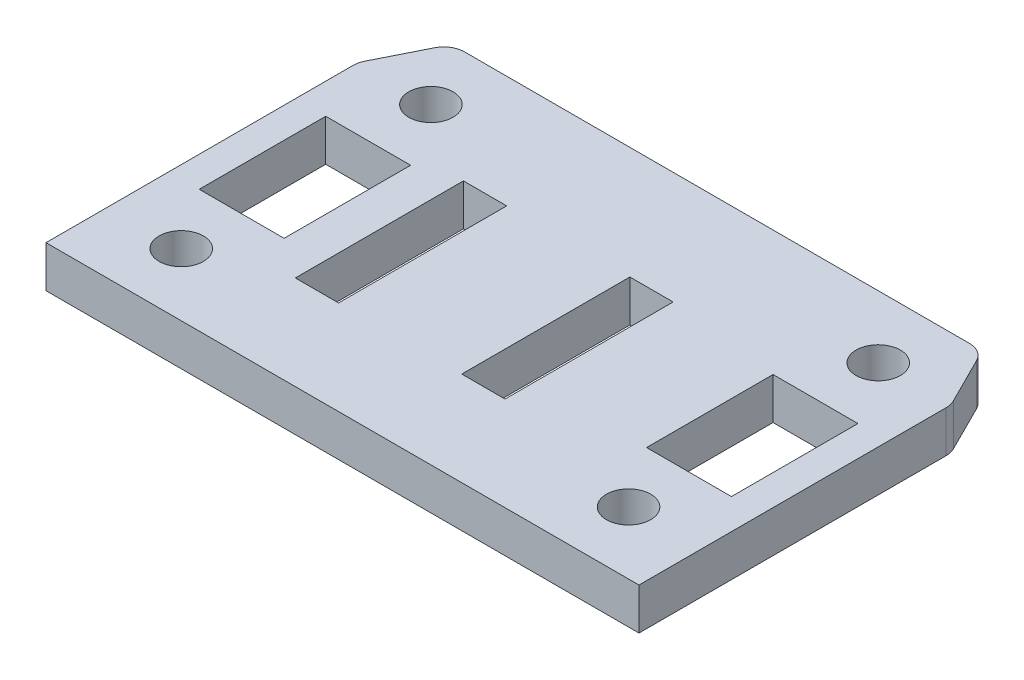
ISO-10303-21;
HEADER;
FILE_DESCRIPTION(('STEP AP214'),'2;1');
FILE_NAME('part.step','',(''),(''),'','','');
FILE_SCHEMA(('AUTOMOTIVE_DESIGN { 1 0 10303 214 1 1 1 1 }'));
ENDSEC;
DATA;
#1=APPLICATION_CONTEXT('core data for automotive mechanical design processes');
#2=APPLICATION_PROTOCOL_DEFINITION('international standard','automotive_design',2000,#1);
#3=PRODUCT_CONTEXT('',#1,'mechanical');
#4=PRODUCT('Part','Part','',(#3));
#5=PRODUCT_RELATED_PRODUCT_CATEGORY('part','',(#4));
#6=PRODUCT_DEFINITION_FORMATION('','',#4);
#7=PRODUCT_DEFINITION_CONTEXT('part definition',#1,'design');
#8=PRODUCT_DEFINITION('design','',#6,#7);
#9=PRODUCT_DEFINITION_SHAPE('','',#8);
#10=(LENGTH_UNIT() NAMED_UNIT(*) SI_UNIT(.MILLI.,.METRE.));
#11=(NAMED_UNIT(*) PLANE_ANGLE_UNIT() SI_UNIT($,.RADIAN.));
#12=(NAMED_UNIT(*) SI_UNIT($,.STERADIAN.) SOLID_ANGLE_UNIT());
#13=UNCERTAINTY_MEASURE_WITH_UNIT(LENGTH_MEASURE(1.E-05),#10,'distance_accuracy_value','');
#14=(GEOMETRIC_REPRESENTATION_CONTEXT(3) GLOBAL_UNCERTAINTY_ASSIGNED_CONTEXT((#13)) GLOBAL_UNIT_ASSIGNED_CONTEXT((#10,
#11,#12)) REPRESENTATION_CONTEXT('',''));
#15=CARTESIAN_POINT('',(0.,0.,0.));
#16=DIRECTION('',(0.,0.,1.));
#17=DIRECTION('',(1.,0.,0.));
#18=AXIS2_PLACEMENT_3D('',#15,#16,#17);
#19=CARTESIAN_POINT('',(-40.48125,6.35,28.575));
#20=DIRECTION('',(0.,0.,-1.));
#21=DIRECTION('',(-1.,0.,0.));
#22=AXIS2_PLACEMENT_3D('',#19,#20,#21);
#23=PLANE('',#22);
#24=DIRECTION('',(1.,0.,0.));
#25=VECTOR('',#24,1.);
#26=CARTESIAN_POINT('',(-40.48125,0.,28.575));
#27=LINE('',#26,#25);
#28=CARTESIAN_POINT('',(-45.24375,0.,28.575));
#29=VERTEX_POINT('',#28);
#30=CARTESIAN_POINT('',(45.24375,0.,28.575));
#31=VERTEX_POINT('',#30);
#32=EDGE_CURVE('E188',#29,#31,#27,.T.);
#33=ORIENTED_EDGE('',*,*,#32,.T.);
#34=DIRECTION('',(0.,1.,0.));
#35=VECTOR('',#34,1.);
#36=CARTESIAN_POINT('',(45.24375,-57.3480941814983,28.575));
#37=LINE('',#36,#35);
#38=CARTESIAN_POINT('',(45.24375,6.35,28.575));
#39=VERTEX_POINT('',#38);
#40=EDGE_CURVE('E186',#31,#39,#37,.T.);
#41=ORIENTED_EDGE('',*,*,#40,.T.);
#42=DIRECTION('',(1.,0.,0.));
#43=VECTOR('',#42,1.);
#44=CARTESIAN_POINT('',(-40.48125,6.35,28.575));
#45=LINE('',#44,#43);
#46=CARTESIAN_POINT('',(-45.24375,6.35,28.575));
#47=VERTEX_POINT('',#46);
#48=EDGE_CURVE('E125',#47,#39,#45,.T.);
#49=ORIENTED_EDGE('',*,*,#48,.F.);
#50=DIRECTION('',(0.,1.,0.));
#51=VECTOR('',#50,1.);
#52=CARTESIAN_POINT('',(-45.24375,-57.3480941814983,28.575));
#53=LINE('',#52,#51);
#54=EDGE_CURVE('E130',#29,#47,#53,.T.);
#55=ORIENTED_EDGE('',*,*,#54,.F.);
#56=EDGE_LOOP('',(#33,#41,#49,#55));
#57=FACE_BOUND('',#56,.T.);
#58=ADVANCED_FACE('F37',(#57),#23,.F.);
#59=CARTESIAN_POINT('',(-40.48125,6.35,-28.575));
#60=DIRECTION('',(0.,0.,1.));
#61=DIRECTION('',(1.,0.,0.));
#62=AXIS2_PLACEMENT_3D('',#59,#60,#61);
#63=PLANE('',#62);
#64=DIRECTION('',(-1.,0.,0.));
#65=VECTOR('',#64,1.);
#66=CARTESIAN_POINT('',(-40.48125,0.,-28.575));
#67=LINE('',#66,#65);
#68=CARTESIAN_POINT('',(38.5189920857191,0.,-28.575));
#69=VERTEX_POINT('',#68);
#70=CARTESIAN_POINT('',(-38.5189920857191,0.,-28.575));
#71=VERTEX_POINT('',#70);
#72=EDGE_CURVE('E154',#69,#71,#67,.T.);
#73=ORIENTED_EDGE('',*,*,#72,.T.);
#74=DIRECTION('',(0.,-1.,0.));
#75=VECTOR('',#74,1.);
#76=CARTESIAN_POINT('',(-38.5189920857191,6.35,-28.575));
#77=LINE('',#76,#75);
#78=CARTESIAN_POINT('',(-38.5189920857191,6.35,-28.575));
#79=VERTEX_POINT('',#78);
#80=EDGE_CURVE('E151',#71,#79,#77,.F.);
#81=ORIENTED_EDGE('',*,*,#80,.T.);
#82=DIRECTION('',(-1.,0.,0.));
#83=VECTOR('',#82,1.);
#84=CARTESIAN_POINT('',(-40.48125,6.35,-28.575));
#85=LINE('',#84,#83);
#86=CARTESIAN_POINT('',(38.5189920857191,6.35,-28.575));
#87=VERTEX_POINT('',#86);
#88=EDGE_CURVE('E109',#87,#79,#85,.T.);
#89=ORIENTED_EDGE('',*,*,#88,.F.);
#90=DIRECTION('',(0.,-1.,0.));
#91=VECTOR('',#90,1.);
#92=CARTESIAN_POINT('',(38.5189920857191,0.,-28.575));
#93=LINE('',#92,#91);
#94=EDGE_CURVE('E147',#87,#69,#93,.T.);
#95=ORIENTED_EDGE('',*,*,#94,.T.);
#96=EDGE_LOOP('',(#73,#81,#89,#95));
#97=FACE_BOUND('',#96,.T.);
#98=ADVANCED_FACE('F442',(#97),#63,.F.);
#99=CARTESIAN_POINT('',(0.,6.35,0.));
#100=DIRECTION('',(0.,-1.,0.));
#101=DIRECTION('',(0.,0.,-1.));
#102=AXIS2_PLACEMENT_3D('',#99,#100,#101);
#103=PLANE('',#102);
#104=DIRECTION('',(0.,0.,-1.));
#105=VECTOR('',#104,1.);
#106=CARTESIAN_POINT('',(40.6082500000001,6.35,9.82893668575267));
#107=LINE('',#106,#105);
#108=CARTESIAN_POINT('',(40.6082500000001,6.35,9.82893668575267));
#109=VERTEX_POINT('',#108);
#110=CARTESIAN_POINT('',(40.6082500000001,6.35,-9.47506331424733));
#111=VERTEX_POINT('',#110);
#112=EDGE_CURVE('E47',#109,#111,#107,.T.);
#113=ORIENTED_EDGE('',*,*,#112,.F.);
#114=DIRECTION('',(1.,0.,0.));
#115=VECTOR('',#114,1.);
#116=CARTESIAN_POINT('',(27.6542500000001,6.35,9.82893668575267));
#117=LINE('',#116,#115);
#118=CARTESIAN_POINT('',(27.6542500000001,6.35,9.82893668575267));
#119=VERTEX_POINT('',#118);
#120=EDGE_CURVE('E89',#119,#109,#117,.T.);
#121=ORIENTED_EDGE('',*,*,#120,.F.);
#122=DIRECTION('',(0.,0.,1.));
#123=VECTOR('',#122,1.);
#124=CARTESIAN_POINT('',(27.6542500000001,6.35,9.82893668575267));
#125=LINE('',#124,#123);
#126=CARTESIAN_POINT('',(27.6542500000001,6.35,-9.47506331424733));
#127=VERTEX_POINT('',#126);
#128=EDGE_CURVE('E75',#127,#119,#125,.T.);
#129=ORIENTED_EDGE('',*,*,#128,.F.);
#130=DIRECTION('',(-1.,0.,0.));
#131=VECTOR('',#130,1.);
#132=CARTESIAN_POINT('',(27.6542500000001,6.35,-9.47506331424733));
#133=LINE('',#132,#131);
#134=EDGE_CURVE('E80',#111,#127,#133,.T.);
#135=ORIENTED_EDGE('',*,*,#134,.F.);
#136=EDGE_LOOP('',(#113,#121,#129,#135));
#137=FACE_BOUND('',#136,.T.);
#138=DIRECTION('',(0.,0.,-1.));
#139=VECTOR('',#138,1.);
#140=CARTESIAN_POINT('',(-27.6542499999999,6.35,9.82893668575267));
#141=LINE('',#140,#139);
#142=CARTESIAN_POINT('',(-27.6542499999999,6.35,9.82893668575267));
#143=VERTEX_POINT('',#142);
#144=CARTESIAN_POINT('',(-27.6542499999999,6.35,-9.47506331424733));
#145=VERTEX_POINT('',#144);
#146=EDGE_CURVE('E733',#143,#145,#141,.T.);
#147=ORIENTED_EDGE('',*,*,#146,.F.);
#148=DIRECTION('',(1.,0.,0.));
#149=VECTOR('',#148,1.);
#150=CARTESIAN_POINT('',(-40.6082499999999,6.35,9.82893668575267));
#151=LINE('',#150,#149);
#152=CARTESIAN_POINT('',(-40.6082499999999,6.35,9.82893668575267));
#153=VERTEX_POINT('',#152);
#154=EDGE_CURVE('E289',#153,#143,#151,.T.);
#155=ORIENTED_EDGE('',*,*,#154,.F.);
#156=DIRECTION('',(0.,0.,1.));
#157=VECTOR('',#156,1.);
#158=CARTESIAN_POINT('',(-40.6082499999999,6.35,9.82893668575267));
#159=LINE('',#158,#157);
#160=CARTESIAN_POINT('',(-40.6082499999999,6.35,-9.47506331424733));
#161=VERTEX_POINT('',#160);
#162=EDGE_CURVE('E745',#161,#153,#159,.T.);
#163=ORIENTED_EDGE('',*,*,#162,.F.);
#164=DIRECTION('',(-1.,0.,0.));
#165=VECTOR('',#164,1.);
#166=CARTESIAN_POINT('',(-40.6082499999999,6.35,-9.47506331424733));
#167=LINE('',#166,#165);
#168=EDGE_CURVE('E742',#145,#161,#167,.T.);
#169=ORIENTED_EDGE('',*,*,#168,.F.);
#170=EDGE_LOOP('',(#147,#155,#163,#169));
#171=FACE_BOUND('',#170,.T.);
#172=CARTESIAN_POINT('',(-34.13125,6.35,-19.05));
#173=DIRECTION('',(0.,1.,0.));
#174=DIRECTION('',(0.,0.,1.));
#175=AXIS2_PLACEMENT_3D('',#172,#173,#174);
#176=CIRCLE('',#175,3.3782);
#177=CARTESIAN_POINT('',(-34.13125,6.35,-15.6718));
#178=VERTEX_POINT('',#177);
#179=EDGE_CURVE('E174',#178,#178,#176,.T.);
#180=ORIENTED_EDGE('',*,*,#179,.F.);
#181=EDGE_LOOP('',(#180));
#182=FACE_BOUND('',#181,.T.);
#183=CARTESIAN_POINT('',(-34.13125,6.35,19.05));
#184=DIRECTION('',(0.,1.,0.));
#185=DIRECTION('',(0.,0.,1.));
#186=AXIS2_PLACEMENT_3D('',#183,#184,#185);
#187=CIRCLE('',#186,3.3782);
#188=CARTESIAN_POINT('',(-34.13125,6.35,22.4282));
#189=VERTEX_POINT('',#188);
#190=EDGE_CURVE('E180',#189,#189,#187,.T.);
#191=ORIENTED_EDGE('',*,*,#190,.F.);
#192=EDGE_LOOP('',(#191));
#193=FACE_BOUND('',#192,.T.);
#194=CARTESIAN_POINT('',(34.13125,6.35,19.05));
#195=DIRECTION('',(0.,1.,0.));
#196=DIRECTION('',(0.,0.,1.));
#197=AXIS2_PLACEMENT_3D('',#194,#195,#196);
#198=CIRCLE('',#197,3.3782);
#199=CARTESIAN_POINT('',(34.13125,6.35,22.4282));
#200=VERTEX_POINT('',#199);
#201=EDGE_CURVE('E197',#200,#200,#198,.T.);
#202=ORIENTED_EDGE('',*,*,#201,.F.);
#203=EDGE_LOOP('',(#202));
#204=FACE_BOUND('',#203,.T.);
#205=CARTESIAN_POINT('',(34.13125,6.35,-19.05));
#206=DIRECTION('',(0.,1.,0.));
#207=DIRECTION('',(0.,0.,1.));
#208=AXIS2_PLACEMENT_3D('',#205,#206,#207);
#209=CIRCLE('',#208,3.3782);
#210=CARTESIAN_POINT('',(34.13125,6.35,-15.6718));
#211=VERTEX_POINT('',#210);
#212=EDGE_CURVE('E203',#211,#211,#209,.T.);
#213=ORIENTED_EDGE('',*,*,#212,.F.);
#214=EDGE_LOOP('',(#213));
#215=FACE_BOUND('',#214,.T.);
#216=DIRECTION('',(0.,0.,1.));
#217=VECTOR('',#216,1.);
#218=CARTESIAN_POINT('',(-14.95425,6.35,14.2166787714717));
#219=LINE('',#218,#217);
#220=CARTESIAN_POINT('',(-14.95425,6.35,-11.4373212285283));
#221=VERTEX_POINT('',#220);
#222=CARTESIAN_POINT('',(-14.95425,6.35,14.2166787714717));
#223=VERTEX_POINT('',#222);
#224=EDGE_CURVE('E150',#221,#223,#219,.T.);
#225=ORIENTED_EDGE('',*,*,#224,.T.);
#226=DIRECTION('',(-1.,0.,0.));
#227=VECTOR('',#226,1.);
#228=CARTESIAN_POINT('',(-21.55825,6.35,14.2166787714717));
#229=LINE('',#228,#227);
#230=CARTESIAN_POINT('',(-21.55825,6.35,14.2166787714717));
#231=VERTEX_POINT('',#230);
#232=EDGE_CURVE('E278',#223,#231,#229,.T.);
#233=ORIENTED_EDGE('',*,*,#232,.T.);
#234=DIRECTION('',(0.,0.,-1.));
#235=VECTOR('',#234,1.);
#236=CARTESIAN_POINT('',(-21.55825,6.35,14.2166787714717));
#237=LINE('',#236,#235);
#238=CARTESIAN_POINT('',(-21.55825,6.35,-11.4373212285283));
#239=VERTEX_POINT('',#238);
#240=EDGE_CURVE('E281',#231,#239,#237,.T.);
#241=ORIENTED_EDGE('',*,*,#240,.T.);
#242=DIRECTION('',(1.,0.,0.));
#243=VECTOR('',#242,1.);
#244=CARTESIAN_POINT('',(-21.55825,6.35,-11.4373212285283));
#245=LINE('',#244,#243);
#246=EDGE_CURVE('E223',#239,#221,#245,.T.);
#247=ORIENTED_EDGE('',*,*,#246,.T.);
#248=EDGE_LOOP('',(#225,#233,#241,#247));
#249=FACE_BOUND('',#248,.T.);
#250=DIRECTION('',(0.,0.,-1.));
#251=VECTOR('',#250,1.);
#252=CARTESIAN_POINT('',(3.84175000000006,6.35,-11.4373212285283));
#253=LINE('',#252,#251);
#254=CARTESIAN_POINT('',(3.84175000000006,6.35,14.2166787714717));
#255=VERTEX_POINT('',#254);
#256=CARTESIAN_POINT('',(3.84175000000006,6.35,-11.4373212285283));
#257=VERTEX_POINT('',#256);
#258=EDGE_CURVE('E216',#255,#257,#253,.T.);
#259=ORIENTED_EDGE('',*,*,#258,.T.);
#260=DIRECTION('',(1.,0.,0.));
#261=VECTOR('',#260,1.);
#262=CARTESIAN_POINT('',(3.84175000000006,6.35,-11.4373212285283));
#263=LINE('',#262,#261);
#264=CARTESIAN_POINT('',(10.4457500000001,6.35,-11.4373212285283));
#265=VERTEX_POINT('',#264);
#266=EDGE_CURVE('E212',#257,#265,#263,.T.);
#267=ORIENTED_EDGE('',*,*,#266,.T.);
#268=DIRECTION('',(0.,0.,1.));
#269=VECTOR('',#268,1.);
#270=CARTESIAN_POINT('',(10.4457500000001,6.35,-11.4373212285283));
#271=LINE('',#270,#269);
#272=CARTESIAN_POINT('',(10.4457500000001,6.35,14.2166787714717));
#273=VERTEX_POINT('',#272);
#274=EDGE_CURVE('E215',#265,#273,#271,.T.);
#275=ORIENTED_EDGE('',*,*,#274,.T.);
#276=DIRECTION('',(-1.,0.,0.));
#277=VECTOR('',#276,1.);
#278=CARTESIAN_POINT('',(3.84175000000006,6.35,14.2166787714717));
#279=LINE('',#278,#277);
#280=EDGE_CURVE('E126',#273,#255,#279,.T.);
#281=ORIENTED_EDGE('',*,*,#280,.T.);
#282=EDGE_LOOP('',(#259,#267,#275,#281));
#283=FACE_BOUND('',#282,.T.);
#284=DIRECTION('',(0.447213595499957,0.,-0.894427190999917));
#285=VECTOR('',#284,1.);
#286=CARTESIAN_POINT('',(-43.815,6.35,-21.9074999999999));
#287=LINE('',#286,#285);
#288=CARTESIAN_POINT('',(-44.9085563314247,6.35,-19.7203873371505));
#289=VERTEX_POINT('',#288);
#290=CARTESIAN_POINT('',(-41.3587984171438,6.35,-26.8199031657124));
#291=VERTEX_POINT('',#290);
#292=EDGE_CURVE('E290',#289,#291,#287,.T.);
#293=ORIENTED_EDGE('',*,*,#292,.F.);
#294=CARTESIAN_POINT('',(-42.06875,6.35,-18.3004841714382));
#295=DIRECTION('',(0.,-1.,0.));
#296=DIRECTION('',(0.,0.,-1.));
#297=AXIS2_PLACEMENT_3D('',#294,#295,#296);
#298=CIRCLE('',#297,3.175);
#299=CARTESIAN_POINT('',(-45.24375,6.35,-18.3004841714382));
#300=VERTEX_POINT('',#299);
#301=EDGE_CURVE('E122',#289,#300,#298,.F.);
#302=ORIENTED_EDGE('',*,*,#301,.T.);
#303=DIRECTION('',(0.,0.,-1.));
#304=VECTOR('',#303,1.);
#305=CARTESIAN_POINT('',(-45.24375,6.35,0.));
#306=LINE('',#305,#304);
#307=EDGE_CURVE('E131',#47,#300,#306,.T.);
#308=ORIENTED_EDGE('',*,*,#307,.F.);
#309=ORIENTED_EDGE('',*,*,#48,.T.);
#310=DIRECTION('',(0.,0.,-1.));
#311=VECTOR('',#310,1.);
#312=CARTESIAN_POINT('',(45.24375,6.35,0.));
#313=LINE('',#312,#311);
#314=CARTESIAN_POINT('',(45.24375,6.35,-18.3004841714381));
#315=VERTEX_POINT('',#314);
#316=EDGE_CURVE('E183',#39,#315,#313,.T.);
#317=ORIENTED_EDGE('',*,*,#316,.T.);
#318=CARTESIAN_POINT('',(42.06875,6.35,-18.3004841714381));
#319=DIRECTION('',(0.,-1.,0.));
#320=DIRECTION('',(0.,0.,-1.));
#321=AXIS2_PLACEMENT_3D('',#318,#319,#320);
#322=CIRCLE('',#321,3.175);
#323=CARTESIAN_POINT('',(44.9085563314247,6.35,-19.7203873371505));
#324=VERTEX_POINT('',#323);
#325=EDGE_CURVE('E293',#315,#324,#322,.F.);
#326=ORIENTED_EDGE('',*,*,#325,.T.);
#327=DIRECTION('',(-0.447213595499958,0.,-0.894427190999916));
#328=VECTOR('',#327,1.);
#329=CARTESIAN_POINT('',(43.815,6.35,-21.9075));
#330=LINE('',#329,#328);
#331=CARTESIAN_POINT('',(41.3587984171438,6.35,-26.8199031657124));
#332=VERTEX_POINT('',#331);
#333=EDGE_CURVE('E295',#324,#332,#330,.T.);
#334=ORIENTED_EDGE('',*,*,#333,.T.);
#335=CARTESIAN_POINT('',(38.5189920857191,6.35,-25.4));
#336=DIRECTION('',(0.,-1.,0.));
#337=DIRECTION('',(0.,0.,-1.));
#338=AXIS2_PLACEMENT_3D('',#335,#336,#337);
#339=CIRCLE('',#338,3.175);
#340=EDGE_CURVE('E117',#332,#87,#339,.F.);
#341=ORIENTED_EDGE('',*,*,#340,.T.);
#342=ORIENTED_EDGE('',*,*,#88,.T.);
#343=CARTESIAN_POINT('',(-38.5189920857191,6.35,-25.4));
#344=DIRECTION('',(0.,-1.,0.));
#345=DIRECTION('',(0.,0.,-1.));
#346=AXIS2_PLACEMENT_3D('',#343,#344,#345);
#347=CIRCLE('',#346,3.175);
#348=EDGE_CURVE('E106',#79,#291,#347,.F.);
#349=ORIENTED_EDGE('',*,*,#348,.T.);
#350=EDGE_LOOP('',(#293,#302,#308,#309,#317,#326,#334,#341,#342,#349));
#351=FACE_BOUND('',#350,.T.);
#352=ADVANCED_FACE('F39',(#137,#171,#182,#193,#204,#215,#249,#283,#351),#103,.F.);
#353=CARTESIAN_POINT('',(0.,0.,0.));
#354=DIRECTION('',(0.,-1.,0.));
#355=DIRECTION('',(0.,0.,-1.));
#356=AXIS2_PLACEMENT_3D('',#353,#354,#355);
#357=PLANE('',#356);
#358=DIRECTION('',(1.,0.,0.));
#359=VECTOR('',#358,1.);
#360=CARTESIAN_POINT('',(27.6542500000001,0.,9.82893668575267));
#361=LINE('',#360,#359);
#362=CARTESIAN_POINT('',(27.6542500000001,0.,9.82893668575267));
#363=VERTEX_POINT('',#362);
#364=CARTESIAN_POINT('',(40.6082500000001,0.,9.82893668575267));
#365=VERTEX_POINT('',#364);
#366=EDGE_CURVE('E41',#363,#365,#361,.T.);
#367=ORIENTED_EDGE('',*,*,#366,.T.);
#368=DIRECTION('',(0.,0.,-1.));
#369=VECTOR('',#368,1.);
#370=CARTESIAN_POINT('',(40.6082500000001,0.,9.82893668575267));
#371=LINE('',#370,#369);
#372=CARTESIAN_POINT('',(40.6082500000001,0.,-9.47506331424733));
#373=VERTEX_POINT('',#372);
#374=EDGE_CURVE('E101',#365,#373,#371,.T.);
#375=ORIENTED_EDGE('',*,*,#374,.T.);
#376=DIRECTION('',(-1.,0.,0.));
#377=VECTOR('',#376,1.);
#378=CARTESIAN_POINT('',(27.6542500000001,0.,-9.47506331424733));
#379=LINE('',#378,#377);
#380=CARTESIAN_POINT('',(27.6542500000001,0.,-9.47506331424733));
#381=VERTEX_POINT('',#380);
#382=EDGE_CURVE('E100',#373,#381,#379,.T.);
#383=ORIENTED_EDGE('',*,*,#382,.T.);
#384=DIRECTION('',(0.,0.,1.));
#385=VECTOR('',#384,1.);
#386=CARTESIAN_POINT('',(27.6542500000001,0.,9.82893668575267));
#387=LINE('',#386,#385);
#388=EDGE_CURVE('E78',#381,#363,#387,.T.);
#389=ORIENTED_EDGE('',*,*,#388,.T.);
#390=EDGE_LOOP('',(#367,#375,#383,#389));
#391=FACE_BOUND('',#390,.T.);
#392=DIRECTION('',(1.,0.,0.));
#393=VECTOR('',#392,1.);
#394=CARTESIAN_POINT('',(-40.6082499999999,0.,9.82893668575267));
#395=LINE('',#394,#393);
#396=CARTESIAN_POINT('',(-40.6082499999999,0.,9.82893668575267));
#397=VERTEX_POINT('',#396);
#398=CARTESIAN_POINT('',(-27.6542499999999,0.,9.82893668575267));
#399=VERTEX_POINT('',#398);
#400=EDGE_CURVE('E99',#397,#399,#395,.T.);
#401=ORIENTED_EDGE('',*,*,#400,.T.);
#402=DIRECTION('',(0.,0.,-1.));
#403=VECTOR('',#402,1.);
#404=CARTESIAN_POINT('',(-27.6542499999999,0.,9.82893668575267));
#405=LINE('',#404,#403);
#406=CARTESIAN_POINT('',(-27.6542499999999,0.,-9.47506331424733));
#407=VERTEX_POINT('',#406);
#408=EDGE_CURVE('E761',#399,#407,#405,.T.);
#409=ORIENTED_EDGE('',*,*,#408,.T.);
#410=DIRECTION('',(-1.,0.,0.));
#411=VECTOR('',#410,1.);
#412=CARTESIAN_POINT('',(-40.6082499999999,0.,-9.47506331424733));
#413=LINE('',#412,#411);
#414=CARTESIAN_POINT('',(-40.6082499999999,0.,-9.47506331424733));
#415=VERTEX_POINT('',#414);
#416=EDGE_CURVE('E758',#407,#415,#413,.T.);
#417=ORIENTED_EDGE('',*,*,#416,.T.);
#418=DIRECTION('',(0.,0.,1.));
#419=VECTOR('',#418,1.);
#420=CARTESIAN_POINT('',(-40.6082499999999,0.,9.82893668575267));
#421=LINE('',#420,#419);
#422=EDGE_CURVE('E194',#415,#397,#421,.T.);
#423=ORIENTED_EDGE('',*,*,#422,.T.);
#424=EDGE_LOOP('',(#401,#409,#417,#423));
#425=FACE_BOUND('',#424,.T.);
#426=CARTESIAN_POINT('',(-34.13125,0.,-19.05));
#427=DIRECTION('',(0.,1.,0.));
#428=DIRECTION('',(0.,0.,1.));
#429=AXIS2_PLACEMENT_3D('',#426,#427,#428);
#430=CIRCLE('',#429,3.3782);
#431=CARTESIAN_POINT('',(-34.13125,0.,-15.6718));
#432=VERTEX_POINT('',#431);
#433=EDGE_CURVE('E190',#432,#432,#430,.T.);
#434=ORIENTED_EDGE('',*,*,#433,.T.);
#435=EDGE_LOOP('',(#434));
#436=FACE_BOUND('',#435,.T.);
#437=CARTESIAN_POINT('',(-34.13125,0.,19.05));
#438=DIRECTION('',(0.,1.,0.));
#439=DIRECTION('',(0.,0.,1.));
#440=AXIS2_PLACEMENT_3D('',#437,#438,#439);
#441=CIRCLE('',#440,3.3782);
#442=CARTESIAN_POINT('',(-34.13125,0.,22.4282));
#443=VERTEX_POINT('',#442);
#444=EDGE_CURVE('E193',#443,#443,#441,.T.);
#445=ORIENTED_EDGE('',*,*,#444,.T.);
#446=EDGE_LOOP('',(#445));
#447=FACE_BOUND('',#446,.T.);
#448=CARTESIAN_POINT('',(34.13125,0.,19.05));
#449=DIRECTION('',(0.,1.,0.));
#450=DIRECTION('',(0.,0.,1.));
#451=AXIS2_PLACEMENT_3D('',#448,#449,#450);
#452=CIRCLE('',#451,3.3782);
#453=CARTESIAN_POINT('',(34.13125,0.,22.4282));
#454=VERTEX_POINT('',#453);
#455=EDGE_CURVE('E200',#454,#454,#452,.T.);
#456=ORIENTED_EDGE('',*,*,#455,.T.);
#457=EDGE_LOOP('',(#456));
#458=FACE_BOUND('',#457,.T.);
#459=CARTESIAN_POINT('',(34.13125,0.,-19.05));
#460=DIRECTION('',(0.,1.,0.));
#461=DIRECTION('',(0.,0.,1.));
#462=AXIS2_PLACEMENT_3D('',#459,#460,#461);
#463=CIRCLE('',#462,3.3782);
#464=CARTESIAN_POINT('',(34.13125,0.,-15.6718));
#465=VERTEX_POINT('',#464);
#466=EDGE_CURVE('E206',#465,#465,#463,.T.);
#467=ORIENTED_EDGE('',*,*,#466,.T.);
#468=EDGE_LOOP('',(#467));
#469=FACE_BOUND('',#468,.T.);
#470=DIRECTION('',(-1.,0.,0.));
#471=VECTOR('',#470,1.);
#472=CARTESIAN_POINT('',(-21.55825,0.,14.2166787714717));
#473=LINE('',#472,#471);
#474=CARTESIAN_POINT('',(-14.95425,0.,14.2166787714717));
#475=VERTEX_POINT('',#474);
#476=CARTESIAN_POINT('',(-21.55825,0.,14.2166787714717));
#477=VERTEX_POINT('',#476);
#478=EDGE_CURVE('E247',#475,#477,#473,.T.);
#479=ORIENTED_EDGE('',*,*,#478,.F.);
#480=DIRECTION('',(0.,0.,1.));
#481=VECTOR('',#480,1.);
#482=CARTESIAN_POINT('',(-14.95425,0.,14.2166787714717));
#483=LINE('',#482,#481);
#484=CARTESIAN_POINT('',(-14.95425,0.,-11.4373212285283));
#485=VERTEX_POINT('',#484);
#486=EDGE_CURVE('E264',#485,#475,#483,.T.);
#487=ORIENTED_EDGE('',*,*,#486,.F.);
#488=DIRECTION('',(1.,0.,0.));
#489=VECTOR('',#488,1.);
#490=CARTESIAN_POINT('',(-21.55825,0.,-11.4373212285283));
#491=LINE('',#490,#489);
#492=CARTESIAN_POINT('',(-21.55825,0.,-11.4373212285283));
#493=VERTEX_POINT('',#492);
#494=EDGE_CURVE('E260',#493,#485,#491,.T.);
#495=ORIENTED_EDGE('',*,*,#494,.F.);
#496=DIRECTION('',(0.,0.,-1.));
#497=VECTOR('',#496,1.);
#498=CARTESIAN_POINT('',(-21.55825,0.,14.2166787714717));
#499=LINE('',#498,#497);
#500=EDGE_CURVE('E256',#477,#493,#499,.T.);
#501=ORIENTED_EDGE('',*,*,#500,.F.);
#502=EDGE_LOOP('',(#479,#487,#495,#501));
#503=FACE_BOUND('',#502,.T.);
#504=DIRECTION('',(1.,0.,0.));
#505=VECTOR('',#504,1.);
#506=CARTESIAN_POINT('',(3.84175000000006,0.,-11.4373212285283));
#507=LINE('',#506,#505);
#508=CARTESIAN_POINT('',(3.84175000000006,0.,-11.4373212285283));
#509=VERTEX_POINT('',#508);
#510=CARTESIAN_POINT('',(10.4457500000001,0.,-11.4373212285283));
#511=VERTEX_POINT('',#510);
#512=EDGE_CURVE('E135',#509,#511,#507,.T.);
#513=ORIENTED_EDGE('',*,*,#512,.F.);
#514=DIRECTION('',(0.,0.,-1.));
#515=VECTOR('',#514,1.);
#516=CARTESIAN_POINT('',(3.84175000000006,0.,-11.4373212285283));
#517=LINE('',#516,#515);
#518=CARTESIAN_POINT('',(3.84175000000006,0.,14.2166787714717));
#519=VERTEX_POINT('',#518);
#520=EDGE_CURVE('E236',#519,#509,#517,.T.);
#521=ORIENTED_EDGE('',*,*,#520,.F.);
#522=DIRECTION('',(-1.,0.,0.));
#523=VECTOR('',#522,1.);
#524=CARTESIAN_POINT('',(3.84175000000006,0.,14.2166787714717));
#525=LINE('',#524,#523);
#526=CARTESIAN_POINT('',(10.4457500000001,0.,14.2166787714717));
#527=VERTEX_POINT('',#526);
#528=EDGE_CURVE('E232',#527,#519,#525,.T.);
#529=ORIENTED_EDGE('',*,*,#528,.F.);
#530=DIRECTION('',(0.,0.,1.));
#531=VECTOR('',#530,1.);
#532=CARTESIAN_POINT('',(10.4457500000001,0.,-11.4373212285283));
#533=LINE('',#532,#531);
#534=EDGE_CURVE('E227',#511,#527,#533,.T.);
#535=ORIENTED_EDGE('',*,*,#534,.F.);
#536=EDGE_LOOP('',(#513,#521,#529,#535));
#537=FACE_BOUND('',#536,.T.);
#538=DIRECTION('',(0.,0.,-1.));
#539=VECTOR('',#538,1.);
#540=CARTESIAN_POINT('',(-45.24375,0.,0.));
#541=LINE('',#540,#539);
#542=CARTESIAN_POINT('',(-45.24375,0.,-18.3004841714382));
#543=VERTEX_POINT('',#542);
#544=EDGE_CURVE('E146',#29,#543,#541,.T.);
#545=ORIENTED_EDGE('',*,*,#544,.T.);
#546=CARTESIAN_POINT('',(-42.06875,0.,-18.3004841714382));
#547=DIRECTION('',(0.,-1.,0.));
#548=DIRECTION('',(0.,0.,-1.));
#549=AXIS2_PLACEMENT_3D('',#546,#547,#548);
#550=CIRCLE('',#549,3.175);
#551=CARTESIAN_POINT('',(-44.9085563314247,0.,-19.7203873371505));
#552=VERTEX_POINT('',#551);
#553=EDGE_CURVE('E143',#543,#552,#550,.T.);
#554=ORIENTED_EDGE('',*,*,#553,.T.);
#555=DIRECTION('',(0.447213595499957,0.,-0.894427190999917));
#556=VECTOR('',#555,1.);
#557=CARTESIAN_POINT('',(-43.815,0.,-21.9074999999999));
#558=LINE('',#557,#556);
#559=CARTESIAN_POINT('',(-41.3587984171438,0.,-26.8199031657124));
#560=VERTEX_POINT('',#559);
#561=EDGE_CURVE('E142',#552,#560,#558,.T.);
#562=ORIENTED_EDGE('',*,*,#561,.T.);
#563=CARTESIAN_POINT('',(-38.5189920857191,0.,-25.4));
#564=DIRECTION('',(0.,-1.,0.));
#565=DIRECTION('',(0.,0.,-1.));
#566=AXIS2_PLACEMENT_3D('',#563,#564,#565);
#567=CIRCLE('',#566,3.175);
#568=EDGE_CURVE('E139',#560,#71,#567,.T.);
#569=ORIENTED_EDGE('',*,*,#568,.T.);
#570=ORIENTED_EDGE('',*,*,#72,.F.);
#571=CARTESIAN_POINT('',(38.5189920857191,0.,-25.4));
#572=DIRECTION('',(0.,-1.,0.));
#573=DIRECTION('',(0.,0.,-1.));
#574=AXIS2_PLACEMENT_3D('',#571,#572,#573);
#575=CIRCLE('',#574,3.175);
#576=CARTESIAN_POINT('',(41.3587984171438,0.,-26.8199031657124));
#577=VERTEX_POINT('',#576);
#578=EDGE_CURVE('E136',#69,#577,#575,.T.);
#579=ORIENTED_EDGE('',*,*,#578,.T.);
#580=DIRECTION('',(-0.447213595499958,0.,-0.894427190999916));
#581=VECTOR('',#580,1.);
#582=CARTESIAN_POINT('',(43.815,0.,-21.9075));
#583=LINE('',#582,#581);
#584=CARTESIAN_POINT('',(44.9085563314247,0.,-19.7203873371505));
#585=VERTEX_POINT('',#584);
#586=EDGE_CURVE('E161',#585,#577,#583,.T.);
#587=ORIENTED_EDGE('',*,*,#586,.F.);
#588=CARTESIAN_POINT('',(42.06875,0.,-18.3004841714381));
#589=DIRECTION('',(0.,-1.,0.));
#590=DIRECTION('',(0.,0.,-1.));
#591=AXIS2_PLACEMENT_3D('',#588,#589,#590);
#592=CIRCLE('',#591,3.175);
#593=CARTESIAN_POINT('',(45.24375,0.,-18.3004841714381));
#594=VERTEX_POINT('',#593);
#595=EDGE_CURVE('E132',#585,#594,#592,.T.);
#596=ORIENTED_EDGE('',*,*,#595,.T.);
#597=DIRECTION('',(0.,0.,-1.));
#598=VECTOR('',#597,1.);
#599=CARTESIAN_POINT('',(45.24375,0.,0.));
#600=LINE('',#599,#598);
#601=EDGE_CURVE('E164',#31,#594,#600,.T.);
#602=ORIENTED_EDGE('',*,*,#601,.F.);
#603=ORIENTED_EDGE('',*,*,#32,.F.);
#604=EDGE_LOOP('',(#545,#554,#562,#569,#570,#579,#587,#596,#602,#603));
#605=FACE_BOUND('',#604,.T.);
#606=ADVANCED_FACE('F430',(#391,#425,#436,#447,#458,#469,#503,#537,#605),#357,.T.);
#607=CARTESIAN_POINT('',(3.84175000000006,6.35,-11.4373212285283));
#608=DIRECTION('',(0.,0.,-1.));
#609=DIRECTION('',(-1.,0.,0.));
#610=AXIS2_PLACEMENT_3D('',#607,#608,#609);
#611=PLANE('',#610);
#612=ORIENTED_EDGE('',*,*,#512,.T.);
#613=DIRECTION('',(0.,-1.,0.));
#614=VECTOR('',#613,1.);
#615=CARTESIAN_POINT('',(10.4457500000001,6.35,-11.4373212285283));
#616=LINE('',#615,#614);
#617=EDGE_CURVE('E230',#265,#511,#616,.T.);
#618=ORIENTED_EDGE('',*,*,#617,.F.);
#619=ORIENTED_EDGE('',*,*,#266,.F.);
#620=DIRECTION('',(0.,-1.,0.));
#621=VECTOR('',#620,1.);
#622=CARTESIAN_POINT('',(3.84175000000006,6.35,-11.4373212285283));
#623=LINE('',#622,#621);
#624=EDGE_CURVE('E226',#257,#509,#623,.T.);
#625=ORIENTED_EDGE('',*,*,#624,.T.);
#626=EDGE_LOOP('',(#612,#618,#619,#625));
#627=FACE_BOUND('',#626,.T.);
#628=ADVANCED_FACE('F504',(#627),#611,.F.);
#629=CARTESIAN_POINT('',(3.84175000000006,6.35,-11.4373212285283));
#630=DIRECTION('',(-1.,0.,0.));
#631=DIRECTION('',(0.,0.,1.));
#632=AXIS2_PLACEMENT_3D('',#629,#630,#631);
#633=PLANE('',#632);
#634=ORIENTED_EDGE('',*,*,#520,.T.);
#635=ORIENTED_EDGE('',*,*,#624,.F.);
#636=ORIENTED_EDGE('',*,*,#258,.F.);
#637=DIRECTION('',(0.,-1.,0.));
#638=VECTOR('',#637,1.);
#639=CARTESIAN_POINT('',(3.84175000000006,6.35,14.2166787714717));
#640=LINE('',#639,#638);
#641=EDGE_CURVE('E235',#255,#519,#640,.T.);
#642=ORIENTED_EDGE('',*,*,#641,.T.);
#643=EDGE_LOOP('',(#634,#635,#636,#642));
#644=FACE_BOUND('',#643,.T.);
#645=ADVANCED_FACE('F500',(#644),#633,.F.);
#646=CARTESIAN_POINT('',(3.84175000000006,6.35,14.2166787714717));
#647=DIRECTION('',(0.,0.,1.));
#648=DIRECTION('',(1.,0.,0.));
#649=AXIS2_PLACEMENT_3D('',#646,#647,#648);
#650=PLANE('',#649);
#651=ORIENTED_EDGE('',*,*,#528,.T.);
#652=ORIENTED_EDGE('',*,*,#641,.F.);
#653=ORIENTED_EDGE('',*,*,#280,.F.);
#654=DIRECTION('',(0.,-1.,0.));
#655=VECTOR('',#654,1.);
#656=CARTESIAN_POINT('',(10.4457500000001,6.35,14.2166787714717));
#657=LINE('',#656,#655);
#658=EDGE_CURVE('E231',#273,#527,#657,.T.);
#659=ORIENTED_EDGE('',*,*,#658,.T.);
#660=EDGE_LOOP('',(#651,#652,#653,#659));
#661=FACE_BOUND('',#660,.T.);
#662=ADVANCED_FACE('F511',(#661),#650,.F.);
#663=CARTESIAN_POINT('',(10.4457500000001,6.35,-11.4373212285283));
#664=DIRECTION('',(1.,0.,0.));
#665=DIRECTION('',(0.,0.,-1.));
#666=AXIS2_PLACEMENT_3D('',#663,#664,#665);
#667=PLANE('',#666);
#668=ORIENTED_EDGE('',*,*,#534,.T.);
#669=ORIENTED_EDGE('',*,*,#658,.F.);
#670=ORIENTED_EDGE('',*,*,#274,.F.);
#671=ORIENTED_EDGE('',*,*,#617,.T.);
#672=EDGE_LOOP('',(#668,#669,#670,#671));
#673=FACE_BOUND('',#672,.T.);
#674=ADVANCED_FACE('F469',(#673),#667,.F.);
#675=CARTESIAN_POINT('',(-21.55825,6.35,14.2166787714717));
#676=DIRECTION('',(0.,0.,1.));
#677=DIRECTION('',(1.,0.,0.));
#678=AXIS2_PLACEMENT_3D('',#675,#676,#677);
#679=PLANE('',#678);
#680=ORIENTED_EDGE('',*,*,#478,.T.);
#681=DIRECTION('',(0.,-1.,0.));
#682=VECTOR('',#681,1.);
#683=CARTESIAN_POINT('',(-21.55825,6.35,14.2166787714717));
#684=LINE('',#683,#682);
#685=EDGE_CURVE('E209',#231,#477,#684,.T.);
#686=ORIENTED_EDGE('',*,*,#685,.F.);
#687=ORIENTED_EDGE('',*,*,#232,.F.);
#688=DIRECTION('',(0.,-1.,0.));
#689=VECTOR('',#688,1.);
#690=CARTESIAN_POINT('',(-14.95425,6.35,14.2166787714717));
#691=LINE('',#690,#689);
#692=EDGE_CURVE('E265',#223,#475,#691,.T.);
#693=ORIENTED_EDGE('',*,*,#692,.T.);
#694=EDGE_LOOP('',(#680,#686,#687,#693));
#695=FACE_BOUND('',#694,.T.);
#696=ADVANCED_FACE('F465',(#695),#679,.F.);
#697=CARTESIAN_POINT('',(-14.95425,6.35,14.2166787714717));
#698=DIRECTION('',(1.,0.,0.));
#699=DIRECTION('',(0.,0.,-1.));
#700=AXIS2_PLACEMENT_3D('',#697,#698,#699);
#701=PLANE('',#700);
#702=ORIENTED_EDGE('',*,*,#486,.T.);
#703=ORIENTED_EDGE('',*,*,#692,.F.);
#704=ORIENTED_EDGE('',*,*,#224,.F.);
#705=DIRECTION('',(0.,-1.,0.));
#706=VECTOR('',#705,1.);
#707=CARTESIAN_POINT('',(-14.95425,6.35,-11.4373212285283));
#708=LINE('',#707,#706);
#709=EDGE_CURVE('E261',#221,#485,#708,.T.);
#710=ORIENTED_EDGE('',*,*,#709,.T.);
#711=EDGE_LOOP('',(#702,#703,#704,#710));
#712=FACE_BOUND('',#711,.T.);
#713=ADVANCED_FACE('F468',(#712),#701,.F.);
#714=CARTESIAN_POINT('',(-21.55825,6.35,-11.4373212285283));
#715=DIRECTION('',(0.,0.,-1.));
#716=DIRECTION('',(-1.,0.,0.));
#717=AXIS2_PLACEMENT_3D('',#714,#715,#716);
#718=PLANE('',#717);
#719=ORIENTED_EDGE('',*,*,#494,.T.);
#720=ORIENTED_EDGE('',*,*,#709,.F.);
#721=ORIENTED_EDGE('',*,*,#246,.F.);
#722=DIRECTION('',(0.,-1.,0.));
#723=VECTOR('',#722,1.);
#724=CARTESIAN_POINT('',(-21.55825,6.35,-11.4373212285283));
#725=LINE('',#724,#723);
#726=EDGE_CURVE('E257',#239,#493,#725,.T.);
#727=ORIENTED_EDGE('',*,*,#726,.T.);
#728=EDGE_LOOP('',(#719,#720,#721,#727));
#729=FACE_BOUND('',#728,.T.);
#730=ADVANCED_FACE('F475',(#729),#718,.F.);
#731=CARTESIAN_POINT('',(-21.55825,6.35,14.2166787714717));
#732=DIRECTION('',(-1.,0.,0.));
#733=DIRECTION('',(0.,0.,1.));
#734=AXIS2_PLACEMENT_3D('',#731,#732,#733);
#735=PLANE('',#734);
#736=ORIENTED_EDGE('',*,*,#500,.T.);
#737=ORIENTED_EDGE('',*,*,#726,.F.);
#738=ORIENTED_EDGE('',*,*,#240,.F.);
#739=ORIENTED_EDGE('',*,*,#685,.T.);
#740=EDGE_LOOP('',(#736,#737,#738,#739));
#741=FACE_BOUND('',#740,.T.);
#742=ADVANCED_FACE('F471',(#741),#735,.F.);
#743=CARTESIAN_POINT('',(34.13125,6.35,-19.05));
#744=DIRECTION('',(0.,1.,0.));
#745=DIRECTION('',(0.,0.,1.));
#746=AXIS2_PLACEMENT_3D('',#743,#744,#745);
#747=CYLINDRICAL_SURFACE('',#746,3.3782);
#748=ORIENTED_EDGE('',*,*,#466,.F.);
#749=EDGE_LOOP('',(#748));
#750=FACE_BOUND('',#749,.T.);
#751=ORIENTED_EDGE('',*,*,#212,.T.);
#752=EDGE_LOOP('',(#751));
#753=FACE_BOUND('',#752,.T.);
#754=ADVANCED_FACE('F474',(#750,#753),#747,.F.);
#755=CARTESIAN_POINT('',(34.13125,6.35,19.05));
#756=DIRECTION('',(0.,1.,0.));
#757=DIRECTION('',(0.,0.,1.));
#758=AXIS2_PLACEMENT_3D('',#755,#756,#757);
#759=CYLINDRICAL_SURFACE('',#758,3.3782);
#760=ORIENTED_EDGE('',*,*,#455,.F.);
#761=EDGE_LOOP('',(#760));
#762=FACE_BOUND('',#761,.T.);
#763=ORIENTED_EDGE('',*,*,#201,.T.);
#764=EDGE_LOOP('',(#763));
#765=FACE_BOUND('',#764,.T.);
#766=ADVANCED_FACE('F563',(#762,#765),#759,.F.);
#767=CARTESIAN_POINT('',(-34.13125,6.35,19.05));
#768=DIRECTION('',(0.,1.,0.));
#769=DIRECTION('',(0.,0.,1.));
#770=AXIS2_PLACEMENT_3D('',#767,#768,#769);
#771=CYLINDRICAL_SURFACE('',#770,3.3782);
#772=ORIENTED_EDGE('',*,*,#444,.F.);
#773=EDGE_LOOP('',(#772));
#774=FACE_BOUND('',#773,.T.);
#775=ORIENTED_EDGE('',*,*,#190,.T.);
#776=EDGE_LOOP('',(#775));
#777=FACE_BOUND('',#776,.T.);
#778=ADVANCED_FACE('F559',(#774,#777),#771,.F.);
#779=CARTESIAN_POINT('',(-34.13125,6.35,-19.05));
#780=DIRECTION('',(0.,1.,0.));
#781=DIRECTION('',(0.,0.,1.));
#782=AXIS2_PLACEMENT_3D('',#779,#780,#781);
#783=CYLINDRICAL_SURFACE('',#782,3.3782);
#784=ORIENTED_EDGE('',*,*,#433,.F.);
#785=EDGE_LOOP('',(#784));
#786=FACE_BOUND('',#785,.T.);
#787=ORIENTED_EDGE('',*,*,#179,.T.);
#788=EDGE_LOOP('',(#787));
#789=FACE_BOUND('',#788,.T.);
#790=ADVANCED_FACE('F553',(#786,#789),#783,.F.);
#791=CARTESIAN_POINT('',(45.24375,-57.3480941814983,0.));
#792=DIRECTION('',(1.,0.,0.));
#793=DIRECTION('',(0.,0.,-1.));
#794=AXIS2_PLACEMENT_3D('',#791,#792,#793);
#795=PLANE('',#794);
#796=ORIENTED_EDGE('',*,*,#601,.T.);
#797=DIRECTION('',(0.,1.,0.));
#798=VECTOR('',#797,1.);
#799=CARTESIAN_POINT('',(45.24375,-57.3480941814983,-18.3004841714381));
#800=LINE('',#799,#798);
#801=EDGE_CURVE('E162',#594,#315,#800,.T.);
#802=ORIENTED_EDGE('',*,*,#801,.T.);
#803=ORIENTED_EDGE('',*,*,#316,.F.);
#804=ORIENTED_EDGE('',*,*,#40,.F.);
#805=EDGE_LOOP('',(#796,#802,#803,#804));
#806=FACE_BOUND('',#805,.T.);
#807=ADVANCED_FACE('F306',(#806),#795,.T.);
#808=CARTESIAN_POINT('',(43.815,-57.3480941814983,-21.9075));
#809=DIRECTION('',(0.894427190999916,0.,-0.447213595499958));
#810=DIRECTION('',(-0.447213595499958,0.,-0.894427190999916));
#811=AXIS2_PLACEMENT_3D('',#808,#809,#810);
#812=PLANE('',#811);
#813=ORIENTED_EDGE('',*,*,#586,.T.);
#814=DIRECTION('',(0.,-1.,0.));
#815=VECTOR('',#814,1.);
#816=CARTESIAN_POINT('',(41.3587984171438,6.35,-26.8199031657124));
#817=LINE('',#816,#815);
#818=EDGE_CURVE('E158',#577,#332,#817,.F.);
#819=ORIENTED_EDGE('',*,*,#818,.T.);
#820=ORIENTED_EDGE('',*,*,#333,.F.);
#821=DIRECTION('',(0.,1.,0.));
#822=VECTOR('',#821,1.);
#823=CARTESIAN_POINT('',(44.9085563314247,-57.3480941814983,-19.7203873371505));
#824=LINE('',#823,#822);
#825=EDGE_CURVE('E155',#324,#585,#824,.F.);
#826=ORIENTED_EDGE('',*,*,#825,.T.);
#827=EDGE_LOOP('',(#813,#819,#820,#826));
#828=FACE_BOUND('',#827,.T.);
#829=ADVANCED_FACE('F544',(#828),#812,.T.);
#830=CARTESIAN_POINT('',(-45.24375,-57.3480941814983,0.));
#831=DIRECTION('',(1.,0.,0.));
#832=DIRECTION('',(0.,0.,-1.));
#833=AXIS2_PLACEMENT_3D('',#830,#831,#832);
#834=PLANE('',#833);
#835=ORIENTED_EDGE('',*,*,#307,.T.);
#836=DIRECTION('',(0.,1.,0.));
#837=VECTOR('',#836,1.);
#838=CARTESIAN_POINT('',(-45.24375,-57.3480941814983,-18.3004841714382));
#839=LINE('',#838,#837);
#840=EDGE_CURVE('E127',#300,#543,#839,.F.);
#841=ORIENTED_EDGE('',*,*,#840,.T.);
#842=ORIENTED_EDGE('',*,*,#544,.F.);
#843=ORIENTED_EDGE('',*,*,#54,.T.);
#844=EDGE_LOOP('',(#835,#841,#842,#843));
#845=FACE_BOUND('',#844,.T.);
#846=ADVANCED_FACE('F417',(#845),#834,.F.);
#847=CARTESIAN_POINT('',(-43.815,-57.3480941814983,-21.9074999999999));
#848=DIRECTION('',(0.894427190999917,0.,0.447213595499957));
#849=DIRECTION('',(0.447213595499957,0.,-0.894427190999917));
#850=AXIS2_PLACEMENT_3D('',#847,#848,#849);
#851=PLANE('',#850);
#852=ORIENTED_EDGE('',*,*,#561,.F.);
#853=DIRECTION('',(0.,1.,0.));
#854=VECTOR('',#853,1.);
#855=CARTESIAN_POINT('',(-44.9085563314247,-57.3480941814983,-19.7203873371505));
#856=LINE('',#855,#854);
#857=EDGE_CURVE('E291',#552,#289,#856,.T.);
#858=ORIENTED_EDGE('',*,*,#857,.T.);
#859=ORIENTED_EDGE('',*,*,#292,.T.);
#860=DIRECTION('',(0.,-1.,0.));
#861=VECTOR('',#860,1.);
#862=CARTESIAN_POINT('',(-41.3587984171438,-57.3480941814983,-26.8199031657124));
#863=LINE('',#862,#861);
#864=EDGE_CURVE('E286',#291,#560,#863,.T.);
#865=ORIENTED_EDGE('',*,*,#864,.T.);
#866=EDGE_LOOP('',(#852,#858,#859,#865));
#867=FACE_BOUND('',#866,.T.);
#868=ADVANCED_FACE('F436',(#867),#851,.F.);
#869=CARTESIAN_POINT('',(-42.06875,-57.3480941814983,-18.3004841714382));
#870=DIRECTION('',(0.,1.,0.));
#871=DIRECTION('',(0.,0.,1.));
#872=AXIS2_PLACEMENT_3D('',#869,#870,#871);
#873=CYLINDRICAL_SURFACE('',#872,3.175);
#874=ORIENTED_EDGE('',*,*,#553,.F.);
#875=ORIENTED_EDGE('',*,*,#840,.F.);
#876=ORIENTED_EDGE('',*,*,#301,.F.);
#877=ORIENTED_EDGE('',*,*,#857,.F.);
#878=EDGE_LOOP('',(#874,#875,#876,#877));
#879=FACE_BOUND('',#878,.T.);
#880=ADVANCED_FACE('F434',(#879),#873,.T.);
#881=CARTESIAN_POINT('',(-38.5189920857191,-57.3480941814983,-25.4));
#882=DIRECTION('',(0.,-1.,0.));
#883=DIRECTION('',(0.,0.,-1.));
#884=AXIS2_PLACEMENT_3D('',#881,#882,#883);
#885=CYLINDRICAL_SURFACE('',#884,3.175);
#886=ORIENTED_EDGE('',*,*,#348,.F.);
#887=ORIENTED_EDGE('',*,*,#80,.F.);
#888=ORIENTED_EDGE('',*,*,#568,.F.);
#889=ORIENTED_EDGE('',*,*,#864,.F.);
#890=EDGE_LOOP('',(#886,#887,#888,#889));
#891=FACE_BOUND('',#890,.T.);
#892=ADVANCED_FACE('F445',(#891),#885,.T.);
#893=CARTESIAN_POINT('',(38.5189920857191,6.35,-25.4));
#894=DIRECTION('',(0.,1.,0.));
#895=DIRECTION('',(0.,0.,1.));
#896=AXIS2_PLACEMENT_3D('',#893,#894,#895);
#897=CYLINDRICAL_SURFACE('',#896,3.175);
#898=ORIENTED_EDGE('',*,*,#340,.F.);
#899=ORIENTED_EDGE('',*,*,#818,.F.);
#900=ORIENTED_EDGE('',*,*,#578,.F.);
#901=ORIENTED_EDGE('',*,*,#94,.F.);
#902=EDGE_LOOP('',(#898,#899,#900,#901));
#903=FACE_BOUND('',#902,.T.);
#904=ADVANCED_FACE('F447',(#903),#897,.T.);
#905=CARTESIAN_POINT('',(42.06875,-57.3480941814983,-18.3004841714381));
#906=DIRECTION('',(0.,1.,0.));
#907=DIRECTION('',(0.,0.,1.));
#908=AXIS2_PLACEMENT_3D('',#905,#906,#907);
#909=CYLINDRICAL_SURFACE('',#908,3.175);
#910=ORIENTED_EDGE('',*,*,#595,.F.);
#911=ORIENTED_EDGE('',*,*,#825,.F.);
#912=ORIENTED_EDGE('',*,*,#325,.F.);
#913=ORIENTED_EDGE('',*,*,#801,.F.);
#914=EDGE_LOOP('',(#910,#911,#912,#913));
#915=FACE_BOUND('',#914,.T.);
#916=ADVANCED_FACE('F453',(#915),#909,.T.);
#917=CARTESIAN_POINT('',(-40.6082499999999,0.,9.82893668575267));
#918=DIRECTION('',(0.,0.,1.));
#919=DIRECTION('',(1.,0.,0.));
#920=AXIS2_PLACEMENT_3D('',#917,#918,#919);
#921=PLANE('',#920);
#922=ORIENTED_EDGE('',*,*,#154,.T.);
#923=DIRECTION('',(0.,1.,0.));
#924=VECTOR('',#923,1.);
#925=CARTESIAN_POINT('',(-27.6542499999999,0.,9.82893668575267));
#926=LINE('',#925,#924);
#927=EDGE_CURVE('E97',#399,#143,#926,.T.);
#928=ORIENTED_EDGE('',*,*,#927,.F.);
#929=ORIENTED_EDGE('',*,*,#400,.F.);
#930=DIRECTION('',(0.,1.,0.));
#931=VECTOR('',#930,1.);
#932=CARTESIAN_POINT('',(-40.6082499999999,0.,9.82893668575267));
#933=LINE('',#932,#931);
#934=EDGE_CURVE('E753',#397,#153,#933,.T.);
#935=ORIENTED_EDGE('',*,*,#934,.T.);
#936=EDGE_LOOP('',(#922,#928,#929,#935));
#937=FACE_BOUND('',#936,.T.);
#938=ADVANCED_FACE('F531',(#937),#921,.F.);
#939=CARTESIAN_POINT('',(-40.6082499999999,0.,9.82893668575267));
#940=DIRECTION('',(-1.,0.,0.));
#941=DIRECTION('',(0.,0.,1.));
#942=AXIS2_PLACEMENT_3D('',#939,#940,#941);
#943=PLANE('',#942);
#944=ORIENTED_EDGE('',*,*,#162,.T.);
#945=ORIENTED_EDGE('',*,*,#934,.F.);
#946=ORIENTED_EDGE('',*,*,#422,.F.);
#947=DIRECTION('',(0.,1.,0.));
#948=VECTOR('',#947,1.);
#949=CARTESIAN_POINT('',(-40.6082499999999,0.,-9.47506331424733));
#950=LINE('',#949,#948);
#951=EDGE_CURVE('E746',#415,#161,#950,.T.);
#952=ORIENTED_EDGE('',*,*,#951,.T.);
#953=EDGE_LOOP('',(#944,#945,#946,#952));
#954=FACE_BOUND('',#953,.T.);
#955=ADVANCED_FACE('F536',(#954),#943,.F.);
#956=CARTESIAN_POINT('',(-40.6082499999999,0.,-9.47506331424733));
#957=DIRECTION('',(0.,0.,-1.));
#958=DIRECTION('',(-1.,0.,0.));
#959=AXIS2_PLACEMENT_3D('',#956,#957,#958);
#960=PLANE('',#959);
#961=ORIENTED_EDGE('',*,*,#168,.T.);
#962=ORIENTED_EDGE('',*,*,#951,.F.);
#963=ORIENTED_EDGE('',*,*,#416,.F.);
#964=DIRECTION('',(0.,1.,0.));
#965=VECTOR('',#964,1.);
#966=CARTESIAN_POINT('',(-27.6542499999999,0.,-9.47506331424733));
#967=LINE('',#966,#965);
#968=EDGE_CURVE('E736',#407,#145,#967,.T.);
#969=ORIENTED_EDGE('',*,*,#968,.T.);
#970=EDGE_LOOP('',(#961,#962,#963,#969));
#971=FACE_BOUND('',#970,.T.);
#972=ADVANCED_FACE('F682',(#971),#960,.F.);
#973=CARTESIAN_POINT('',(-27.6542499999999,0.,9.82893668575267));
#974=DIRECTION('',(1.,0.,0.));
#975=DIRECTION('',(0.,0.,-1.));
#976=AXIS2_PLACEMENT_3D('',#973,#974,#975);
#977=PLANE('',#976);
#978=ORIENTED_EDGE('',*,*,#146,.T.);
#979=ORIENTED_EDGE('',*,*,#968,.F.);
#980=ORIENTED_EDGE('',*,*,#408,.F.);
#981=ORIENTED_EDGE('',*,*,#927,.T.);
#982=EDGE_LOOP('',(#978,#979,#980,#981));
#983=FACE_BOUND('',#982,.T.);
#984=ADVANCED_FACE('F529',(#983),#977,.F.);
#985=CARTESIAN_POINT('',(27.6542500000001,0.,9.82893668575267));
#986=DIRECTION('',(0.,0.,1.));
#987=DIRECTION('',(1.,0.,0.));
#988=AXIS2_PLACEMENT_3D('',#985,#986,#987);
#989=PLANE('',#988);
#990=ORIENTED_EDGE('',*,*,#120,.T.);
#991=DIRECTION('',(0.,1.,0.));
#992=VECTOR('',#991,1.);
#993=CARTESIAN_POINT('',(40.6082500000001,0.,9.82893668575267));
#994=LINE('',#993,#992);
#995=EDGE_CURVE('E11',#365,#109,#994,.T.);
#996=ORIENTED_EDGE('',*,*,#995,.F.);
#997=ORIENTED_EDGE('',*,*,#366,.F.);
#998=DIRECTION('',(0.,1.,0.));
#999=VECTOR('',#998,1.);
#1000=CARTESIAN_POINT('',(27.6542500000001,0.,9.82893668575267));
#1001=LINE('',#1000,#999);
#1002=EDGE_CURVE('E90',#363,#119,#1001,.T.);
#1003=ORIENTED_EDGE('',*,*,#1002,.T.);
#1004=EDGE_LOOP('',(#990,#996,#997,#1003));
#1005=FACE_BOUND('',#1004,.T.);
#1006=ADVANCED_FACE('F520',(#1005),#989,.F.);
#1007=CARTESIAN_POINT('',(27.6542500000001,0.,9.82893668575267));
#1008=DIRECTION('',(-1.,0.,0.));
#1009=DIRECTION('',(0.,0.,1.));
#1010=AXIS2_PLACEMENT_3D('',#1007,#1008,#1009);
#1011=PLANE('',#1010);
#1012=ORIENTED_EDGE('',*,*,#128,.T.);
#1013=ORIENTED_EDGE('',*,*,#1002,.F.);
#1014=ORIENTED_EDGE('',*,*,#388,.F.);
#1015=DIRECTION('',(0.,1.,0.));
#1016=VECTOR('',#1015,1.);
#1017=CARTESIAN_POINT('',(27.6542500000001,0.,-9.47506331424733));
#1018=LINE('',#1017,#1016);
#1019=EDGE_CURVE('E69',#381,#127,#1018,.T.);
#1020=ORIENTED_EDGE('',*,*,#1019,.T.);
#1021=EDGE_LOOP('',(#1012,#1013,#1014,#1020));
#1022=FACE_BOUND('',#1021,.T.);
#1023=ADVANCED_FACE('F73',(#1022),#1011,.F.);
#1024=CARTESIAN_POINT('',(27.6542500000001,0.,-9.47506331424733));
#1025=DIRECTION('',(0.,0.,-1.));
#1026=DIRECTION('',(-1.,0.,0.));
#1027=AXIS2_PLACEMENT_3D('',#1024,#1025,#1026);
#1028=PLANE('',#1027);
#1029=ORIENTED_EDGE('',*,*,#134,.T.);
#1030=ORIENTED_EDGE('',*,*,#1019,.F.);
#1031=ORIENTED_EDGE('',*,*,#382,.F.);
#1032=DIRECTION('',(0.,1.,0.));
#1033=VECTOR('',#1032,1.);
#1034=CARTESIAN_POINT('',(40.6082500000001,0.,-9.47506331424733));
#1035=LINE('',#1034,#1033);
#1036=EDGE_CURVE('E56',#373,#111,#1035,.T.);
#1037=ORIENTED_EDGE('',*,*,#1036,.T.);
#1038=EDGE_LOOP('',(#1029,#1030,#1031,#1037));
#1039=FACE_BOUND('',#1038,.T.);
#1040=ADVANCED_FACE('F83',(#1039),#1028,.F.);
#1041=CARTESIAN_POINT('',(40.6082500000001,0.,9.82893668575267));
#1042=DIRECTION('',(1.,0.,0.));
#1043=DIRECTION('',(0.,0.,-1.));
#1044=AXIS2_PLACEMENT_3D('',#1041,#1042,#1043);
#1045=PLANE('',#1044);
#1046=ORIENTED_EDGE('',*,*,#112,.T.);
#1047=ORIENTED_EDGE('',*,*,#1036,.F.);
#1048=ORIENTED_EDGE('',*,*,#374,.F.);
#1049=ORIENTED_EDGE('',*,*,#995,.T.);
#1050=EDGE_LOOP('',(#1046,#1047,#1048,#1049));
#1051=FACE_BOUND('',#1050,.T.);
#1052=ADVANCED_FACE('F523',(#1051),#1045,.F.);
#1053=CLOSED_SHELL('',(#58,#98,#352,#606,#628,#645,#662,#674,#696,#713,#730,#742,#754,#766,#778,
#790,#807,#829,#846,#868,#880,#892,#904,#916,#938,#955,#972,#984,#1006,#1023,#1040,#1052));
#1054=MANIFOLD_SOLID_BREP('B2',#1053);
#1055=ADVANCED_BREP_SHAPE_REPRESENTATION('',(#18,#1054),#14);
#1056=SHAPE_DEFINITION_REPRESENTATION(#9,#1055);
ENDSEC;
END-ISO-10303-21;
